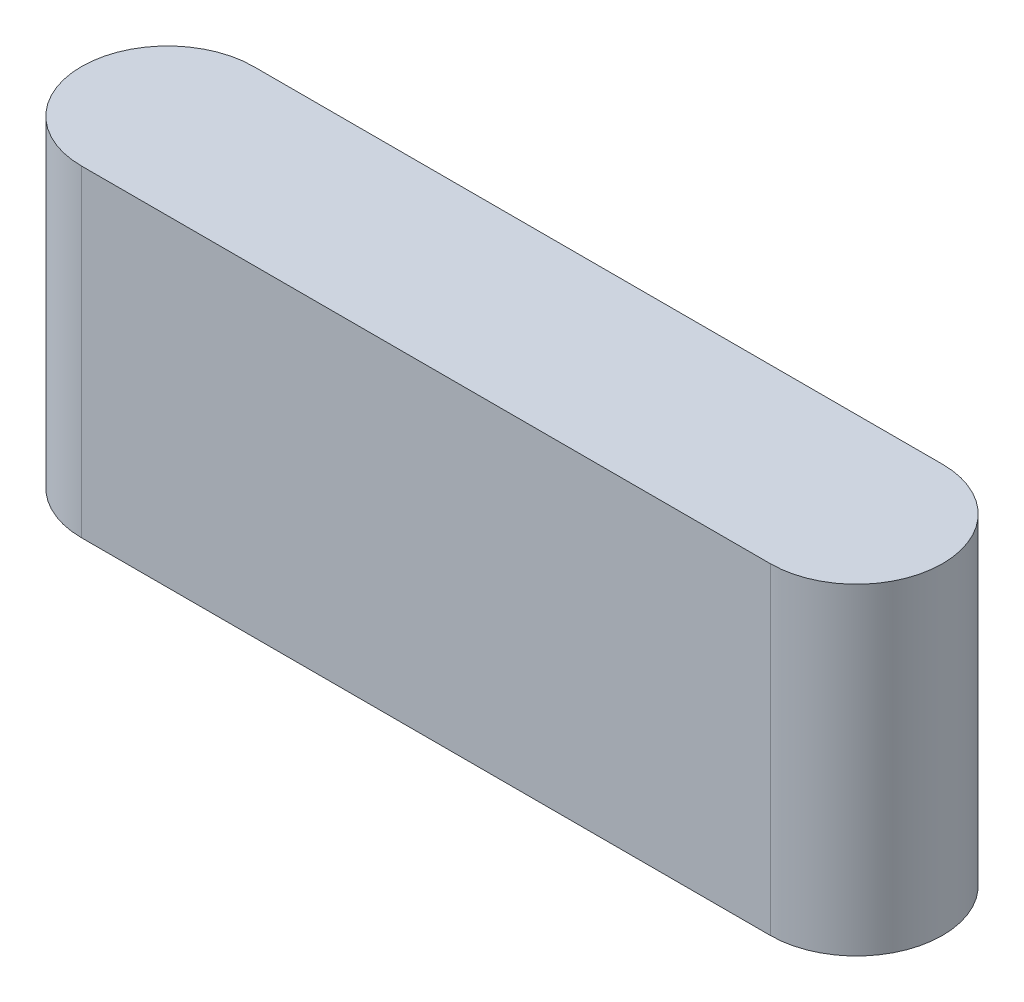
ISO-10303-21;
HEADER;
FILE_DESCRIPTION(('STEP AP214'),'2;1');
FILE_NAME('part.step','',(''),(''),'','','');
FILE_SCHEMA(('AUTOMOTIVE_DESIGN { 1 0 10303 214 1 1 1 1 }'));
ENDSEC;
DATA;
#1=APPLICATION_CONTEXT('core data for automotive mechanical design processes');
#2=APPLICATION_PROTOCOL_DEFINITION('international standard','automotive_design',2000,#1);
#3=PRODUCT_CONTEXT('',#1,'mechanical');
#4=PRODUCT('Part','Part','',(#3));
#5=PRODUCT_RELATED_PRODUCT_CATEGORY('part','',(#4));
#6=PRODUCT_DEFINITION_FORMATION('','',#4);
#7=PRODUCT_DEFINITION_CONTEXT('part definition',#1,'design');
#8=PRODUCT_DEFINITION('design','',#6,#7);
#9=PRODUCT_DEFINITION_SHAPE('','',#8);
#10=(LENGTH_UNIT() NAMED_UNIT(*) SI_UNIT(.MILLI.,.METRE.));
#11=(NAMED_UNIT(*) PLANE_ANGLE_UNIT() SI_UNIT($,.RADIAN.));
#12=(NAMED_UNIT(*) SI_UNIT($,.STERADIAN.) SOLID_ANGLE_UNIT());
#13=UNCERTAINTY_MEASURE_WITH_UNIT(LENGTH_MEASURE(1.E-05),#10,'distance_accuracy_value','');
#14=(GEOMETRIC_REPRESENTATION_CONTEXT(3) GLOBAL_UNCERTAINTY_ASSIGNED_CONTEXT((#13)) GLOBAL_UNIT_ASSIGNED_CONTEXT((#10,
#11,#12)) REPRESENTATION_CONTEXT('',''));
#15=CARTESIAN_POINT('',(0.,0.,0.));
#16=DIRECTION('',(0.,0.,1.));
#17=DIRECTION('',(1.,0.,0.));
#18=AXIS2_PLACEMENT_3D('',#15,#16,#17);
#19=CARTESIAN_POINT('',(0.,43.,0.));
#20=DIRECTION('',(0.,-1.,0.));
#21=DIRECTION('',(0.,0.,-1.));
#22=AXIS2_PLACEMENT_3D('',#19,#20,#21);
#23=CYLINDRICAL_SURFACE('',#22,11.5);
#24=CARTESIAN_POINT('',(0.,0.,0.));
#25=DIRECTION('',(0.,1.,0.));
#26=DIRECTION('',(0.,0.,1.));
#27=AXIS2_PLACEMENT_3D('',#24,#25,#26);
#28=CIRCLE('',#27,11.5);
#29=CARTESIAN_POINT('',(0.,0.,-11.5));
#30=VERTEX_POINT('',#29);
#31=CARTESIAN_POINT('',(0.,0.,11.5));
#32=VERTEX_POINT('',#31);
#33=EDGE_CURVE('E97',#30,#32,#28,.T.);
#34=ORIENTED_EDGE('',*,*,#33,.T.);
#35=DIRECTION('',(0.,-1.,0.));
#36=VECTOR('',#35,1.);
#37=CARTESIAN_POINT('',(0.,43.,11.5));
#38=LINE('',#37,#36);
#39=CARTESIAN_POINT('',(0.,43.,11.5));
#40=VERTEX_POINT('',#39);
#41=EDGE_CURVE('E11',#40,#32,#38,.T.);
#42=ORIENTED_EDGE('',*,*,#41,.F.);
#43=CARTESIAN_POINT('',(0.,43.,0.));
#44=DIRECTION('',(0.,1.,0.));
#45=DIRECTION('',(0.,0.,1.));
#46=AXIS2_PLACEMENT_3D('',#43,#44,#45);
#47=CIRCLE('',#46,11.5);
#48=CARTESIAN_POINT('',(0.,43.,-11.5));
#49=VERTEX_POINT('',#48);
#50=EDGE_CURVE('E85',#49,#40,#47,.T.);
#51=ORIENTED_EDGE('',*,*,#50,.F.);
#52=DIRECTION('',(0.,-1.,0.));
#53=VECTOR('',#52,1.);
#54=CARTESIAN_POINT('',(0.,43.,-11.5));
#55=LINE('',#54,#53);
#56=EDGE_CURVE('E93',#49,#30,#55,.T.);
#57=ORIENTED_EDGE('',*,*,#56,.T.);
#58=EDGE_LOOP('',(#34,#42,#51,#57));
#59=FACE_BOUND('',#58,.T.);
#60=ADVANCED_FACE('F34',(#59),#23,.T.);
#61=CARTESIAN_POINT('',(0.,43.,11.5));
#62=DIRECTION('',(0.,0.,-1.));
#63=DIRECTION('',(-1.,0.,0.));
#64=AXIS2_PLACEMENT_3D('',#61,#62,#63);
#65=PLANE('',#64);
#66=DIRECTION('',(1.,0.,0.));
#67=VECTOR('',#66,1.);
#68=CARTESIAN_POINT('',(0.,0.,11.5));
#69=LINE('',#68,#67);
#70=CARTESIAN_POINT('',(92.,0.,11.5));
#71=VERTEX_POINT('',#70);
#72=EDGE_CURVE('E89',#32,#71,#69,.T.);
#73=ORIENTED_EDGE('',*,*,#72,.T.);
#74=DIRECTION('',(0.,-1.,0.));
#75=VECTOR('',#74,1.);
#76=CARTESIAN_POINT('',(92.,43.,11.5));
#77=LINE('',#76,#75);
#78=CARTESIAN_POINT('',(92.,43.,11.5));
#79=VERTEX_POINT('',#78);
#80=EDGE_CURVE('E42',#79,#71,#77,.T.);
#81=ORIENTED_EDGE('',*,*,#80,.F.);
#82=DIRECTION('',(1.,0.,0.));
#83=VECTOR('',#82,1.);
#84=CARTESIAN_POINT('',(0.,43.,11.5));
#85=LINE('',#84,#83);
#86=EDGE_CURVE('E80',#40,#79,#85,.T.);
#87=ORIENTED_EDGE('',*,*,#86,.F.);
#88=ORIENTED_EDGE('',*,*,#41,.T.);
#89=EDGE_LOOP('',(#73,#81,#87,#88));
#90=FACE_BOUND('',#89,.T.);
#91=ADVANCED_FACE('F88',(#90),#65,.F.);
#92=CARTESIAN_POINT('',(92.,43.,0.));
#93=DIRECTION('',(0.,-1.,0.));
#94=DIRECTION('',(0.,0.,-1.));
#95=AXIS2_PLACEMENT_3D('',#92,#93,#94);
#96=CYLINDRICAL_SURFACE('',#95,11.5);
#97=CARTESIAN_POINT('',(92.,0.,0.));
#98=DIRECTION('',(0.,1.,0.));
#99=DIRECTION('',(0.,0.,1.));
#100=AXIS2_PLACEMENT_3D('',#97,#98,#99);
#101=CIRCLE('',#100,11.5);
#102=CARTESIAN_POINT('',(92.,0.,-11.5));
#103=VERTEX_POINT('',#102);
#104=EDGE_CURVE('E67',#71,#103,#101,.T.);
#105=ORIENTED_EDGE('',*,*,#104,.T.);
#106=DIRECTION('',(0.,-1.,0.));
#107=VECTOR('',#106,1.);
#108=CARTESIAN_POINT('',(92.,43.,-11.5));
#109=LINE('',#108,#107);
#110=CARTESIAN_POINT('',(92.,43.,-11.5));
#111=VERTEX_POINT('',#110);
#112=EDGE_CURVE('E90',#111,#103,#109,.T.);
#113=ORIENTED_EDGE('',*,*,#112,.F.);
#114=CARTESIAN_POINT('',(92.,43.,0.));
#115=DIRECTION('',(0.,1.,0.));
#116=DIRECTION('',(0.,0.,1.));
#117=AXIS2_PLACEMENT_3D('',#114,#115,#116);
#118=CIRCLE('',#117,11.5);
#119=EDGE_CURVE('E83',#79,#111,#118,.T.);
#120=ORIENTED_EDGE('',*,*,#119,.F.);
#121=ORIENTED_EDGE('',*,*,#80,.T.);
#122=EDGE_LOOP('',(#105,#113,#120,#121));
#123=FACE_BOUND('',#122,.T.);
#124=ADVANCED_FACE('F91',(#123),#96,.T.);
#125=CARTESIAN_POINT('',(0.,43.,-11.5));
#126=DIRECTION('',(0.,0.,1.));
#127=DIRECTION('',(1.,0.,0.));
#128=AXIS2_PLACEMENT_3D('',#125,#126,#127);
#129=PLANE('',#128);
#130=DIRECTION('',(-1.,0.,0.));
#131=VECTOR('',#130,1.);
#132=CARTESIAN_POINT('',(0.,0.,-11.5));
#133=LINE('',#132,#131);
#134=EDGE_CURVE('E73',#103,#30,#133,.T.);
#135=ORIENTED_EDGE('',*,*,#134,.T.);
#136=ORIENTED_EDGE('',*,*,#56,.F.);
#137=DIRECTION('',(-1.,0.,0.));
#138=VECTOR('',#137,1.);
#139=CARTESIAN_POINT('',(0.,43.,-11.5));
#140=LINE('',#139,#138);
#141=EDGE_CURVE('E50',#111,#49,#140,.T.);
#142=ORIENTED_EDGE('',*,*,#141,.F.);
#143=ORIENTED_EDGE('',*,*,#112,.T.);
#144=EDGE_LOOP('',(#135,#136,#142,#143));
#145=FACE_BOUND('',#144,.T.);
#146=ADVANCED_FACE('F104',(#145),#129,.F.);
#147=CARTESIAN_POINT('',(0.,43.,0.));
#148=DIRECTION('',(0.,1.,0.));
#149=DIRECTION('',(0.,0.,1.));
#150=AXIS2_PLACEMENT_3D('',#147,#148,#149);
#151=PLANE('',#150);
#152=ORIENTED_EDGE('',*,*,#50,.T.);
#153=ORIENTED_EDGE('',*,*,#86,.T.);
#154=ORIENTED_EDGE('',*,*,#119,.T.);
#155=ORIENTED_EDGE('',*,*,#141,.T.);
#156=EDGE_LOOP('',(#152,#153,#154,#155));
#157=FACE_BOUND('',#156,.T.);
#158=ADVANCED_FACE('F81',(#157),#151,.T.);
#159=CARTESIAN_POINT('',(0.,0.,0.));
#160=DIRECTION('',(0.,1.,0.));
#161=DIRECTION('',(0.,0.,1.));
#162=AXIS2_PLACEMENT_3D('',#159,#160,#161);
#163=PLANE('',#162);
#164=ORIENTED_EDGE('',*,*,#33,.F.);
#165=ORIENTED_EDGE('',*,*,#134,.F.);
#166=ORIENTED_EDGE('',*,*,#104,.F.);
#167=ORIENTED_EDGE('',*,*,#72,.F.);
#168=EDGE_LOOP('',(#164,#165,#166,#167));
#169=FACE_BOUND('',#168,.T.);
#170=ADVANCED_FACE('F107',(#169),#163,.F.);
#171=CLOSED_SHELL('',(#60,#91,#124,#146,#158,#170));
#172=MANIFOLD_SOLID_BREP('B2',#171);
#173=ADVANCED_BREP_SHAPE_REPRESENTATION('',(#18,#172),#14);
#174=SHAPE_DEFINITION_REPRESENTATION(#9,#173);
ENDSEC;
END-ISO-10303-21;
